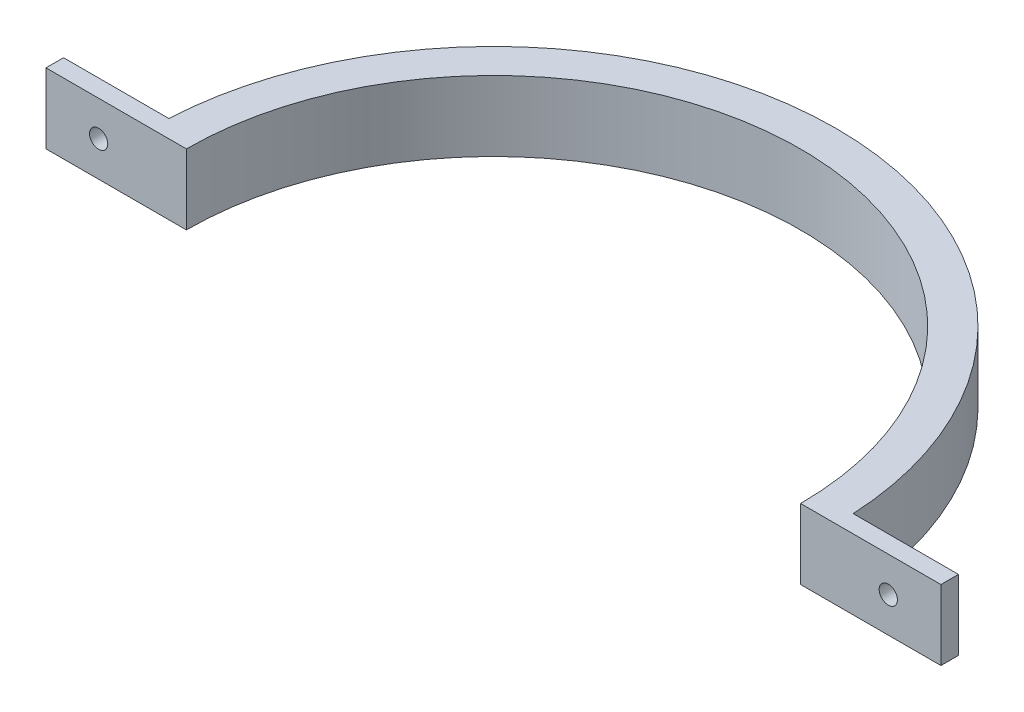
ISO-10303-21;
HEADER;
FILE_DESCRIPTION(('STEP AP214'),'2;1');
FILE_NAME('part.step','',(''),(''),'','','');
FILE_SCHEMA(('AUTOMOTIVE_DESIGN { 1 0 10303 214 1 1 1 1 }'));
ENDSEC;
DATA;
#1=APPLICATION_CONTEXT('core data for automotive mechanical design processes');
#2=APPLICATION_PROTOCOL_DEFINITION('international standard','automotive_design',2000,#1);
#3=PRODUCT_CONTEXT('',#1,'mechanical');
#4=PRODUCT('Part','Part','',(#3));
#5=PRODUCT_RELATED_PRODUCT_CATEGORY('part','',(#4));
#6=PRODUCT_DEFINITION_FORMATION('','',#4);
#7=PRODUCT_DEFINITION_CONTEXT('part definition',#1,'design');
#8=PRODUCT_DEFINITION('design','',#6,#7);
#9=PRODUCT_DEFINITION_SHAPE('','',#8);
#10=(LENGTH_UNIT() NAMED_UNIT(*) SI_UNIT(.MILLI.,.METRE.));
#11=(NAMED_UNIT(*) PLANE_ANGLE_UNIT() SI_UNIT($,.RADIAN.));
#12=(NAMED_UNIT(*) SI_UNIT($,.STERADIAN.) SOLID_ANGLE_UNIT());
#13=UNCERTAINTY_MEASURE_WITH_UNIT(LENGTH_MEASURE(1.E-05),#10,'distance_accuracy_value','');
#14=(GEOMETRIC_REPRESENTATION_CONTEXT(3) GLOBAL_UNCERTAINTY_ASSIGNED_CONTEXT((#13)) GLOBAL_UNIT_ASSIGNED_CONTEXT((#10,
#11,#12)) REPRESENTATION_CONTEXT('',''));
#15=CARTESIAN_POINT('',(0.,0.,0.));
#16=DIRECTION('',(0.,0.,1.));
#17=DIRECTION('',(1.,0.,0.));
#18=AXIS2_PLACEMENT_3D('',#15,#16,#17);
#19=CARTESIAN_POINT('',(0.,12.7,0.));
#20=DIRECTION('',(0.,-1.,0.));
#21=DIRECTION('',(0.,0.,-1.));
#22=AXIS2_PLACEMENT_3D('',#19,#20,#21);
#23=CYLINDRICAL_SURFACE('',#22,55.5625);
#24=CARTESIAN_POINT('',(0.,0.,0.));
#25=DIRECTION('',(0.,-1.,0.));
#26=DIRECTION('',(0.,0.,-1.));
#27=AXIS2_PLACEMENT_3D('',#24,#25,#26);
#28=CIRCLE('',#27,55.5625);
#29=CARTESIAN_POINT('',(-55.5625,0.,0.));
#30=VERTEX_POINT('',#29);
#31=CARTESIAN_POINT('',(55.5625,0.,0.));
#32=VERTEX_POINT('',#31);
#33=EDGE_CURVE('E144',#30,#32,#28,.T.);
#34=ORIENTED_EDGE('',*,*,#33,.T.);
#35=DIRECTION('',(0.,-1.,0.));
#36=VECTOR('',#35,1.);
#37=CARTESIAN_POINT('',(55.5625,12.7,0.));
#38=LINE('',#37,#36);
#39=CARTESIAN_POINT('',(55.5625,12.7,0.));
#40=VERTEX_POINT('',#39);
#41=EDGE_CURVE('E11',#40,#32,#38,.T.);
#42=ORIENTED_EDGE('',*,*,#41,.F.);
#43=CARTESIAN_POINT('',(0.,12.7,0.));
#44=DIRECTION('',(0.,-1.,0.));
#45=DIRECTION('',(0.,0.,-1.));
#46=AXIS2_PLACEMENT_3D('',#43,#44,#45);
#47=CIRCLE('',#46,55.5625);
#48=CARTESIAN_POINT('',(-55.5625,12.7,0.));
#49=VERTEX_POINT('',#48);
#50=EDGE_CURVE('E167',#49,#40,#47,.T.);
#51=ORIENTED_EDGE('',*,*,#50,.F.);
#52=DIRECTION('',(0.,-1.,0.));
#53=VECTOR('',#52,1.);
#54=CARTESIAN_POINT('',(-55.5625,12.7,0.));
#55=LINE('',#54,#53);
#56=EDGE_CURVE('E140',#49,#30,#55,.T.);
#57=ORIENTED_EDGE('',*,*,#56,.T.);
#58=EDGE_LOOP('',(#34,#42,#51,#57));
#59=FACE_BOUND('',#58,.T.);
#60=ADVANCED_FACE('F43',(#59),#23,.F.);
#61=CARTESIAN_POINT('',(55.5625,12.7,0.));
#62=DIRECTION('',(0.,0.,-1.));
#63=DIRECTION('',(-1.,0.,0.));
#64=AXIS2_PLACEMENT_3D('',#61,#62,#63);
#65=PLANE('',#64);
#66=CARTESIAN_POINT('',(71.4375,6.35,0.));
#67=DIRECTION('',(0.,0.,1.));
#68=DIRECTION('',(1.,0.,0.));
#69=AXIS2_PLACEMENT_3D('',#66,#67,#68);
#70=CIRCLE('',#69,1.65100000000001);
#71=CARTESIAN_POINT('',(73.0885,6.35,0.));
#72=VERTEX_POINT('',#71);
#73=EDGE_CURVE('E215',#72,#72,#70,.T.);
#74=ORIENTED_EDGE('',*,*,#73,.F.);
#75=EDGE_LOOP('',(#74));
#76=FACE_BOUND('',#75,.T.);
#77=DIRECTION('',(1.,0.,0.));
#78=VECTOR('',#77,1.);
#79=CARTESIAN_POINT('',(55.5625,0.,0.));
#80=LINE('',#79,#78);
#81=CARTESIAN_POINT('',(80.9625,0.,0.));
#82=VERTEX_POINT('',#81);
#83=EDGE_CURVE('E148',#32,#82,#80,.T.);
#84=ORIENTED_EDGE('',*,*,#83,.T.);
#85=DIRECTION('',(0.,-1.,0.));
#86=VECTOR('',#85,1.);
#87=CARTESIAN_POINT('',(80.9625,12.7,0.));
#88=LINE('',#87,#86);
#89=CARTESIAN_POINT('',(80.9625,12.7,0.));
#90=VERTEX_POINT('',#89);
#91=EDGE_CURVE('E52',#90,#82,#88,.T.);
#92=ORIENTED_EDGE('',*,*,#91,.F.);
#93=DIRECTION('',(1.,0.,0.));
#94=VECTOR('',#93,1.);
#95=CARTESIAN_POINT('',(55.5625,12.7,0.));
#96=LINE('',#95,#94);
#97=EDGE_CURVE('E103',#40,#90,#96,.T.);
#98=ORIENTED_EDGE('',*,*,#97,.F.);
#99=ORIENTED_EDGE('',*,*,#41,.T.);
#100=EDGE_LOOP('',(#84,#92,#98,#99));
#101=FACE_BOUND('',#100,.T.);
#102=ADVANCED_FACE('F230',(#76,#101),#65,.F.);
#103=CARTESIAN_POINT('',(80.9625,12.7,0.));
#104=DIRECTION('',(-1.,0.,0.));
#105=DIRECTION('',(0.,0.,1.));
#106=AXIS2_PLACEMENT_3D('',#103,#104,#105);
#107=PLANE('',#106);
#108=DIRECTION('',(0.,0.,-1.));
#109=VECTOR('',#108,1.);
#110=CARTESIAN_POINT('',(80.9625,0.,0.));
#111=LINE('',#110,#109);
#112=CARTESIAN_POINT('',(80.9625,0.,-3.175));
#113=VERTEX_POINT('',#112);
#114=EDGE_CURVE('E152',#82,#113,#111,.T.);
#115=ORIENTED_EDGE('',*,*,#114,.T.);
#116=DIRECTION('',(0.,-1.,0.));
#117=VECTOR('',#116,1.);
#118=CARTESIAN_POINT('',(80.9625,12.7,-3.175));
#119=LINE('',#118,#117);
#120=CARTESIAN_POINT('',(80.9625,12.7,-3.175));
#121=VERTEX_POINT('',#120);
#122=EDGE_CURVE('E178',#121,#113,#119,.T.);
#123=ORIENTED_EDGE('',*,*,#122,.F.);
#124=DIRECTION('',(0.,0.,-1.));
#125=VECTOR('',#124,1.);
#126=CARTESIAN_POINT('',(80.9625,12.7,0.));
#127=LINE('',#126,#125);
#128=EDGE_CURVE('E188',#90,#121,#127,.T.);
#129=ORIENTED_EDGE('',*,*,#128,.F.);
#130=ORIENTED_EDGE('',*,*,#91,.T.);
#131=EDGE_LOOP('',(#115,#123,#129,#130));
#132=FACE_BOUND('',#131,.T.);
#133=ADVANCED_FACE('F186',(#132),#107,.F.);
#134=CARTESIAN_POINT('',(80.9625,12.7,-3.175));
#135=DIRECTION('',(0.,0.,1.));
#136=DIRECTION('',(1.,0.,0.));
#137=AXIS2_PLACEMENT_3D('',#134,#135,#136);
#138=PLANE('',#137);
#139=CARTESIAN_POINT('',(71.4375,6.35,-3.175));
#140=DIRECTION('',(0.,0.,1.));
#141=DIRECTION('',(1.,0.,0.));
#142=AXIS2_PLACEMENT_3D('',#139,#140,#141);
#143=CIRCLE('',#142,1.65100000000001);
#144=CARTESIAN_POINT('',(73.0885,6.35,-3.175));
#145=VERTEX_POINT('',#144);
#146=EDGE_CURVE('E219',#145,#145,#143,.T.);
#147=ORIENTED_EDGE('',*,*,#146,.T.);
#148=EDGE_LOOP('',(#147));
#149=FACE_BOUND('',#148,.T.);
#150=DIRECTION('',(-1.,0.,0.));
#151=VECTOR('',#150,1.);
#152=CARTESIAN_POINT('',(80.9625,0.,-3.175));
#153=LINE('',#152,#151);
#154=CARTESIAN_POINT('',(61.9125,0.,-3.17499999999999));
#155=VERTEX_POINT('',#154);
#156=EDGE_CURVE('E155',#113,#155,#153,.T.);
#157=ORIENTED_EDGE('',*,*,#156,.T.);
#158=DIRECTION('',(0.,-1.,0.));
#159=VECTOR('',#158,1.);
#160=CARTESIAN_POINT('',(61.9125,12.7,-3.17499999999999));
#161=LINE('',#160,#159);
#162=CARTESIAN_POINT('',(61.9125,12.7,-3.17499999999999));
#163=VERTEX_POINT('',#162);
#164=EDGE_CURVE('E174',#163,#155,#161,.T.);
#165=ORIENTED_EDGE('',*,*,#164,.F.);
#166=DIRECTION('',(-1.,0.,0.));
#167=VECTOR('',#166,1.);
#168=CARTESIAN_POINT('',(80.9625,12.7,-3.175));
#169=LINE('',#168,#167);
#170=EDGE_CURVE('E201',#121,#163,#169,.T.);
#171=ORIENTED_EDGE('',*,*,#170,.F.);
#172=ORIENTED_EDGE('',*,*,#122,.T.);
#173=EDGE_LOOP('',(#157,#165,#171,#172));
#174=FACE_BOUND('',#173,.T.);
#175=ADVANCED_FACE('F196',(#149,#174),#138,.F.);
#176=CARTESIAN_POINT('',(0.,12.7,0.));
#177=DIRECTION('',(0.,-1.,0.));
#178=DIRECTION('',(0.,0.,-1.));
#179=AXIS2_PLACEMENT_3D('',#176,#177,#178);
#180=CYLINDRICAL_SURFACE('',#179,61.9938568025091);
#181=CARTESIAN_POINT('',(0.,0.,0.));
#182=DIRECTION('',(0.,1.,0.));
#183=DIRECTION('',(0.,0.,-1.));
#184=AXIS2_PLACEMENT_3D('',#181,#182,#183);
#185=CIRCLE('',#184,61.9938568025091);
#186=CARTESIAN_POINT('',(-61.9125,0.,-3.175));
#187=VERTEX_POINT('',#186);
#188=EDGE_CURVE('E158',#155,#187,#185,.T.);
#189=ORIENTED_EDGE('',*,*,#188,.T.);
#190=DIRECTION('',(0.,-1.,0.));
#191=VECTOR('',#190,1.);
#192=CARTESIAN_POINT('',(-61.9125,12.7,-3.175));
#193=LINE('',#192,#191);
#194=CARTESIAN_POINT('',(-61.9125,12.7,-3.175));
#195=VERTEX_POINT('',#194);
#196=EDGE_CURVE('E133',#195,#187,#193,.T.);
#197=ORIENTED_EDGE('',*,*,#196,.F.);
#198=CARTESIAN_POINT('',(0.,12.7,0.));
#199=DIRECTION('',(0.,1.,0.));
#200=DIRECTION('',(0.,0.,-1.));
#201=AXIS2_PLACEMENT_3D('',#198,#199,#200);
#202=CIRCLE('',#201,61.9938568025091);
#203=EDGE_CURVE('E122',#163,#195,#202,.T.);
#204=ORIENTED_EDGE('',*,*,#203,.F.);
#205=ORIENTED_EDGE('',*,*,#164,.T.);
#206=EDGE_LOOP('',(#189,#197,#204,#205));
#207=FACE_BOUND('',#206,.T.);
#208=ADVANCED_FACE('F199',(#207),#180,.T.);
#209=CARTESIAN_POINT('',(-80.9625,12.7,-3.175));
#210=DIRECTION('',(0.,0.,1.));
#211=DIRECTION('',(1.,0.,0.));
#212=AXIS2_PLACEMENT_3D('',#209,#210,#211);
#213=PLANE('',#212);
#214=CARTESIAN_POINT('',(-71.4375,6.35,-3.175));
#215=DIRECTION('',(0.,0.,-1.));
#216=DIRECTION('',(-1.,0.,0.));
#217=AXIS2_PLACEMENT_3D('',#214,#215,#216);
#218=CIRCLE('',#217,1.65100000000001);
#219=CARTESIAN_POINT('',(-73.0885,6.35,-3.175));
#220=VERTEX_POINT('',#219);
#221=EDGE_CURVE('E211',#220,#220,#218,.T.);
#222=ORIENTED_EDGE('',*,*,#221,.F.);
#223=EDGE_LOOP('',(#222));
#224=FACE_BOUND('',#223,.T.);
#225=DIRECTION('',(-1.,0.,0.));
#226=VECTOR('',#225,1.);
#227=CARTESIAN_POINT('',(-80.9625,0.,-3.175));
#228=LINE('',#227,#226);
#229=CARTESIAN_POINT('',(-80.9625,0.,-3.175));
#230=VERTEX_POINT('',#229);
#231=EDGE_CURVE('E131',#187,#230,#228,.T.);
#232=ORIENTED_EDGE('',*,*,#231,.T.);
#233=DIRECTION('',(0.,-1.,0.));
#234=VECTOR('',#233,1.);
#235=CARTESIAN_POINT('',(-80.9625,12.7,-3.175));
#236=LINE('',#235,#234);
#237=CARTESIAN_POINT('',(-80.9625,12.7,-3.175));
#238=VERTEX_POINT('',#237);
#239=EDGE_CURVE('E128',#238,#230,#236,.T.);
#240=ORIENTED_EDGE('',*,*,#239,.F.);
#241=DIRECTION('',(-1.,0.,0.));
#242=VECTOR('',#241,1.);
#243=CARTESIAN_POINT('',(-80.9625,12.7,-3.175));
#244=LINE('',#243,#242);
#245=EDGE_CURVE('E116',#195,#238,#244,.T.);
#246=ORIENTED_EDGE('',*,*,#245,.F.);
#247=ORIENTED_EDGE('',*,*,#196,.T.);
#248=EDGE_LOOP('',(#232,#240,#246,#247));
#249=FACE_BOUND('',#248,.T.);
#250=ADVANCED_FACE('F129',(#224,#249),#213,.F.);
#251=CARTESIAN_POINT('',(-80.9625,12.7,0.));
#252=DIRECTION('',(1.,0.,0.));
#253=DIRECTION('',(0.,0.,-1.));
#254=AXIS2_PLACEMENT_3D('',#251,#252,#253);
#255=PLANE('',#254);
#256=DIRECTION('',(0.,0.,1.));
#257=VECTOR('',#256,1.);
#258=CARTESIAN_POINT('',(-80.9625,0.,0.));
#259=LINE('',#258,#257);
#260=CARTESIAN_POINT('',(-80.9625,0.,0.));
#261=VERTEX_POINT('',#260);
#262=EDGE_CURVE('E89',#230,#261,#259,.T.);
#263=ORIENTED_EDGE('',*,*,#262,.T.);
#264=DIRECTION('',(0.,-1.,0.));
#265=VECTOR('',#264,1.);
#266=CARTESIAN_POINT('',(-80.9625,12.7,0.));
#267=LINE('',#266,#265);
#268=CARTESIAN_POINT('',(-80.9625,12.7,0.));
#269=VERTEX_POINT('',#268);
#270=EDGE_CURVE('E134',#269,#261,#267,.T.);
#271=ORIENTED_EDGE('',*,*,#270,.F.);
#272=DIRECTION('',(0.,0.,1.));
#273=VECTOR('',#272,1.);
#274=CARTESIAN_POINT('',(-80.9625,12.7,0.));
#275=LINE('',#274,#273);
#276=EDGE_CURVE('E120',#238,#269,#275,.T.);
#277=ORIENTED_EDGE('',*,*,#276,.F.);
#278=ORIENTED_EDGE('',*,*,#239,.T.);
#279=EDGE_LOOP('',(#263,#271,#277,#278));
#280=FACE_BOUND('',#279,.T.);
#281=ADVANCED_FACE('F136',(#280),#255,.F.);
#282=CARTESIAN_POINT('',(-55.5625,12.7,0.));
#283=DIRECTION('',(0.,0.,-1.));
#284=DIRECTION('',(-1.,0.,0.));
#285=AXIS2_PLACEMENT_3D('',#282,#283,#284);
#286=PLANE('',#285);
#287=CARTESIAN_POINT('',(-71.4375,6.35,0.));
#288=DIRECTION('',(0.,0.,-1.));
#289=DIRECTION('',(-1.,0.,0.));
#290=AXIS2_PLACEMENT_3D('',#287,#288,#289);
#291=CIRCLE('',#290,1.65100000000001);
#292=CARTESIAN_POINT('',(-73.0885,6.35,0.));
#293=VERTEX_POINT('',#292);
#294=EDGE_CURVE('E149',#293,#293,#291,.T.);
#295=ORIENTED_EDGE('',*,*,#294,.T.);
#296=EDGE_LOOP('',(#295));
#297=FACE_BOUND('',#296,.T.);
#298=DIRECTION('',(1.,0.,0.));
#299=VECTOR('',#298,1.);
#300=CARTESIAN_POINT('',(-55.5625,0.,0.));
#301=LINE('',#300,#299);
#302=EDGE_CURVE('E95',#261,#30,#301,.T.);
#303=ORIENTED_EDGE('',*,*,#302,.T.);
#304=ORIENTED_EDGE('',*,*,#56,.F.);
#305=DIRECTION('',(1.,0.,0.));
#306=VECTOR('',#305,1.);
#307=CARTESIAN_POINT('',(-55.5625,12.7,0.));
#308=LINE('',#307,#306);
#309=EDGE_CURVE('E60',#269,#49,#308,.T.);
#310=ORIENTED_EDGE('',*,*,#309,.F.);
#311=ORIENTED_EDGE('',*,*,#270,.T.);
#312=EDGE_LOOP('',(#303,#304,#310,#311));
#313=FACE_BOUND('',#312,.T.);
#314=ADVANCED_FACE('F235',(#297,#313),#286,.F.);
#315=CARTESIAN_POINT('',(0.,12.7,0.));
#316=DIRECTION('',(0.,-1.,0.));
#317=DIRECTION('',(0.,0.,-1.));
#318=AXIS2_PLACEMENT_3D('',#315,#316,#317);
#319=PLANE('',#318);
#320=ORIENTED_EDGE('',*,*,#50,.T.);
#321=ORIENTED_EDGE('',*,*,#97,.T.);
#322=ORIENTED_EDGE('',*,*,#128,.T.);
#323=ORIENTED_EDGE('',*,*,#170,.T.);
#324=ORIENTED_EDGE('',*,*,#203,.T.);
#325=ORIENTED_EDGE('',*,*,#245,.T.);
#326=ORIENTED_EDGE('',*,*,#276,.T.);
#327=ORIENTED_EDGE('',*,*,#309,.T.);
#328=EDGE_LOOP('',(#320,#321,#322,#323,#324,#325,#326,#327));
#329=FACE_BOUND('',#328,.T.);
#330=ADVANCED_FACE('F118',(#329),#319,.F.);
#331=CARTESIAN_POINT('',(0.,0.,0.));
#332=DIRECTION('',(0.,-1.,0.));
#333=DIRECTION('',(0.,0.,-1.));
#334=AXIS2_PLACEMENT_3D('',#331,#332,#333);
#335=PLANE('',#334);
#336=ORIENTED_EDGE('',*,*,#33,.F.);
#337=ORIENTED_EDGE('',*,*,#302,.F.);
#338=ORIENTED_EDGE('',*,*,#262,.F.);
#339=ORIENTED_EDGE('',*,*,#231,.F.);
#340=ORIENTED_EDGE('',*,*,#188,.F.);
#341=ORIENTED_EDGE('',*,*,#156,.F.);
#342=ORIENTED_EDGE('',*,*,#114,.F.);
#343=ORIENTED_EDGE('',*,*,#83,.F.);
#344=EDGE_LOOP('',(#336,#337,#338,#339,#340,#341,#342,#343));
#345=FACE_BOUND('',#344,.T.);
#346=ADVANCED_FACE('F192',(#345),#335,.T.);
#347=CARTESIAN_POINT('',(-71.4375,6.35,0.));
#348=DIRECTION('',(0.,0.,-1.));
#349=DIRECTION('',(-1.,0.,0.));
#350=AXIS2_PLACEMENT_3D('',#347,#348,#349);
#351=CYLINDRICAL_SURFACE('',#350,1.65100000000001);
#352=ORIENTED_EDGE('',*,*,#294,.F.);
#353=EDGE_LOOP('',(#352));
#354=FACE_BOUND('',#353,.T.);
#355=ORIENTED_EDGE('',*,*,#221,.T.);
#356=EDGE_LOOP('',(#355));
#357=FACE_BOUND('',#356,.T.);
#358=ADVANCED_FACE('F305',(#354,#357),#351,.F.);
#359=CARTESIAN_POINT('',(71.4375,6.35,0.));
#360=DIRECTION('',(0.,0.,-1.));
#361=DIRECTION('',(-1.,0.,0.));
#362=AXIS2_PLACEMENT_3D('',#359,#360,#361);
#363=CYLINDRICAL_SURFACE('',#362,1.65100000000001);
#364=ORIENTED_EDGE('',*,*,#73,.T.);
#365=EDGE_LOOP('',(#364));
#366=FACE_BOUND('',#365,.T.);
#367=ORIENTED_EDGE('',*,*,#146,.F.);
#368=EDGE_LOOP('',(#367));
#369=FACE_BOUND('',#368,.T.);
#370=ADVANCED_FACE('F227',(#366,#369),#363,.F.);
#371=CLOSED_SHELL('',(#60,#102,#133,#175,#208,#250,#281,#314,#330,#346,#358,#370));
#372=MANIFOLD_SOLID_BREP('B2',#371);
#373=ADVANCED_BREP_SHAPE_REPRESENTATION('',(#18,#372),#14);
#374=SHAPE_DEFINITION_REPRESENTATION(#9,#373);
ENDSEC;
END-ISO-10303-21;
